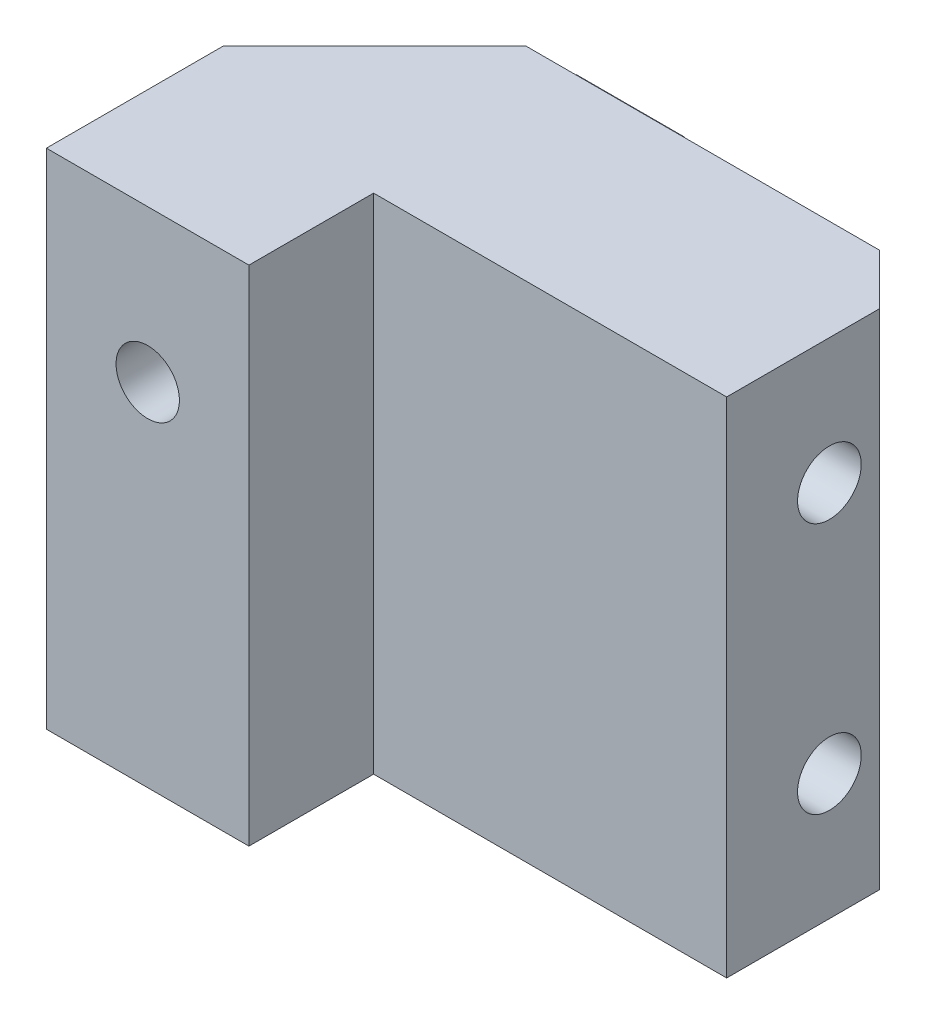
ISO-10303-21;
HEADER;
FILE_DESCRIPTION(('STEP AP214'),'2;1');
FILE_NAME('part.step','',(''),(''),'','','');
FILE_SCHEMA(('AUTOMOTIVE_DESIGN { 1 0 10303 214 1 1 1 1 }'));
ENDSEC;
DATA;
#1=APPLICATION_CONTEXT('core data for automotive mechanical design processes');
#2=APPLICATION_PROTOCOL_DEFINITION('international standard','automotive_design',2000,#1);
#3=PRODUCT_CONTEXT('',#1,'mechanical');
#4=PRODUCT('Part','Part','',(#3));
#5=PRODUCT_RELATED_PRODUCT_CATEGORY('part','',(#4));
#6=PRODUCT_DEFINITION_FORMATION('','',#4);
#7=PRODUCT_DEFINITION_CONTEXT('part definition',#1,'design');
#8=PRODUCT_DEFINITION('design','',#6,#7);
#9=PRODUCT_DEFINITION_SHAPE('','',#8);
#10=(LENGTH_UNIT() NAMED_UNIT(*) SI_UNIT(.MILLI.,.METRE.));
#11=(NAMED_UNIT(*) PLANE_ANGLE_UNIT() SI_UNIT($,.RADIAN.));
#12=(NAMED_UNIT(*) SI_UNIT($,.STERADIAN.) SOLID_ANGLE_UNIT());
#13=UNCERTAINTY_MEASURE_WITH_UNIT(LENGTH_MEASURE(1.E-05),#10,'distance_accuracy_value','');
#14=(GEOMETRIC_REPRESENTATION_CONTEXT(3) GLOBAL_UNCERTAINTY_ASSIGNED_CONTEXT((#13)) GLOBAL_UNIT_ASSIGNED_CONTEXT((#10,
#11,#12)) REPRESENTATION_CONTEXT('',''));
#15=CARTESIAN_POINT('',(0.,0.,0.));
#16=DIRECTION('',(0.,0.,1.));
#17=DIRECTION('',(1.,0.,0.));
#18=AXIS2_PLACEMENT_3D('',#15,#16,#17);
#19=CARTESIAN_POINT('',(12.25,-15.5,-21.47));
#20=DIRECTION('',(-1.,0.,0.));
#21=DIRECTION('',(0.,0.,1.));
#22=AXIS2_PLACEMENT_3D('',#19,#20,#21);
#23=PLANE('',#22);
#24=DIRECTION('',(0.,-1.,0.));
#25=VECTOR('',#24,1.);
#26=CARTESIAN_POINT('',(12.25,-15.5,-20.61));
#27=LINE('',#26,#25);
#28=CARTESIAN_POINT('',(12.25,14.97,-20.61));
#29=VERTEX_POINT('',#28);
#30=CARTESIAN_POINT('',(12.25,-15.5,-20.61));
#31=VERTEX_POINT('',#30);
#32=EDGE_CURVE('E106',#29,#31,#27,.T.);
#33=ORIENTED_EDGE('',*,*,#32,.T.);
#34=DIRECTION('',(0.,0.,1.));
#35=VECTOR('',#34,1.);
#36=CARTESIAN_POINT('',(12.25,-15.5,-21.47));
#37=LINE('',#36,#35);
#38=CARTESIAN_POINT('',(12.25,-15.5,-21.47));
#39=VERTEX_POINT('',#38);
#40=EDGE_CURVE('E12',#39,#31,#37,.T.);
#41=ORIENTED_EDGE('',*,*,#40,.F.);
#42=DIRECTION('',(0.,-1.,0.));
#43=VECTOR('',#42,1.);
#44=CARTESIAN_POINT('',(12.25,-15.5,-21.47));
#45=LINE('',#44,#43);
#46=CARTESIAN_POINT('',(12.25,14.97,-21.47));
#47=VERTEX_POINT('',#46);
#48=EDGE_CURVE('E94',#47,#39,#45,.T.);
#49=ORIENTED_EDGE('',*,*,#48,.F.);
#50=DIRECTION('',(0.,0.,1.));
#51=VECTOR('',#50,1.);
#52=CARTESIAN_POINT('',(12.25,14.97,-21.47));
#53=LINE('',#52,#51);
#54=EDGE_CURVE('E102',#47,#29,#53,.T.);
#55=ORIENTED_EDGE('',*,*,#54,.T.);
#56=EDGE_LOOP('',(#33,#41,#49,#55));
#57=FACE_BOUND('',#56,.T.);
#58=ADVANCED_FACE('F43',(#57),#23,.F.);
#59=CARTESIAN_POINT('',(12.25,-15.5,-21.47));
#60=DIRECTION('',(0.,1.,0.));
#61=DIRECTION('',(0.,0.,1.));
#62=AXIS2_PLACEMENT_3D('',#59,#60,#61);
#63=PLANE('',#62);
#64=DIRECTION('',(-1.,0.,0.));
#65=VECTOR('',#64,1.);
#66=CARTESIAN_POINT('',(12.25,-15.5,-20.61));
#67=LINE('',#66,#65);
#68=CARTESIAN_POINT('',(5.43500000000002,-15.5,-20.61));
#69=VERTEX_POINT('',#68);
#70=EDGE_CURVE('E98',#31,#69,#67,.T.);
#71=ORIENTED_EDGE('',*,*,#70,.T.);
#72=DIRECTION('',(0.,0.,1.));
#73=VECTOR('',#72,1.);
#74=CARTESIAN_POINT('',(5.43500000000002,-15.5,-21.47));
#75=LINE('',#74,#73);
#76=CARTESIAN_POINT('',(5.43500000000002,-15.5,-21.47));
#77=VERTEX_POINT('',#76);
#78=EDGE_CURVE('E51',#77,#69,#75,.T.);
#79=ORIENTED_EDGE('',*,*,#78,.F.);
#80=DIRECTION('',(-1.,0.,0.));
#81=VECTOR('',#80,1.);
#82=CARTESIAN_POINT('',(12.25,-15.5,-21.47));
#83=LINE('',#82,#81);
#84=EDGE_CURVE('E89',#39,#77,#83,.T.);
#85=ORIENTED_EDGE('',*,*,#84,.F.);
#86=ORIENTED_EDGE('',*,*,#40,.T.);
#87=EDGE_LOOP('',(#71,#79,#85,#86));
#88=FACE_BOUND('',#87,.T.);
#89=ADVANCED_FACE('F97',(#88),#63,.F.);
#90=CARTESIAN_POINT('',(5.43500000000002,-15.5,-21.47));
#91=DIRECTION('',(1.,0.,0.));
#92=DIRECTION('',(0.,0.,-1.));
#93=AXIS2_PLACEMENT_3D('',#90,#91,#92);
#94=PLANE('',#93);
#95=DIRECTION('',(0.,1.,0.));
#96=VECTOR('',#95,1.);
#97=CARTESIAN_POINT('',(5.43500000000002,-15.5,-20.61));
#98=LINE('',#97,#96);
#99=CARTESIAN_POINT('',(5.43500000000002,14.97,-20.61));
#100=VERTEX_POINT('',#99);
#101=EDGE_CURVE('E76',#69,#100,#98,.T.);
#102=ORIENTED_EDGE('',*,*,#101,.T.);
#103=DIRECTION('',(0.,0.,1.));
#104=VECTOR('',#103,1.);
#105=CARTESIAN_POINT('',(5.43500000000002,14.97,-21.47));
#106=LINE('',#105,#104);
#107=CARTESIAN_POINT('',(5.43500000000002,14.97,-21.47));
#108=VERTEX_POINT('',#107);
#109=EDGE_CURVE('E99',#108,#100,#106,.T.);
#110=ORIENTED_EDGE('',*,*,#109,.F.);
#111=DIRECTION('',(0.,1.,0.));
#112=VECTOR('',#111,1.);
#113=CARTESIAN_POINT('',(5.43500000000002,-15.5,-21.47));
#114=LINE('',#113,#112);
#115=EDGE_CURVE('E92',#77,#108,#114,.T.);
#116=ORIENTED_EDGE('',*,*,#115,.F.);
#117=ORIENTED_EDGE('',*,*,#78,.T.);
#118=EDGE_LOOP('',(#102,#110,#116,#117));
#119=FACE_BOUND('',#118,.T.);
#120=ADVANCED_FACE('F100',(#119),#94,.F.);
#121=CARTESIAN_POINT('',(12.25,14.97,-21.47));
#122=DIRECTION('',(0.,-1.,0.));
#123=DIRECTION('',(0.,0.,-1.));
#124=AXIS2_PLACEMENT_3D('',#121,#122,#123);
#125=PLANE('',#124);
#126=DIRECTION('',(1.,0.,0.));
#127=VECTOR('',#126,1.);
#128=CARTESIAN_POINT('',(12.25,14.97,-20.61));
#129=LINE('',#128,#127);
#130=EDGE_CURVE('E82',#100,#29,#129,.T.);
#131=ORIENTED_EDGE('',*,*,#130,.T.);
#132=ORIENTED_EDGE('',*,*,#54,.F.);
#133=DIRECTION('',(1.,0.,0.));
#134=VECTOR('',#133,1.);
#135=CARTESIAN_POINT('',(12.25,14.97,-21.47));
#136=LINE('',#135,#134);
#137=EDGE_CURVE('E59',#108,#47,#136,.T.);
#138=ORIENTED_EDGE('',*,*,#137,.F.);
#139=ORIENTED_EDGE('',*,*,#109,.T.);
#140=EDGE_LOOP('',(#131,#132,#138,#139));
#141=FACE_BOUND('',#140,.T.);
#142=ADVANCED_FACE('F113',(#141),#125,.F.);
#143=CARTESIAN_POINT('',(12.25,14.97,-21.47));
#144=DIRECTION('',(0.,0.,1.));
#145=DIRECTION('',(1.,0.,0.));
#146=AXIS2_PLACEMENT_3D('',#143,#144,#145);
#147=PLANE('',#146);
#148=ORIENTED_EDGE('',*,*,#48,.T.);
#149=ORIENTED_EDGE('',*,*,#84,.T.);
#150=ORIENTED_EDGE('',*,*,#115,.T.);
#151=ORIENTED_EDGE('',*,*,#137,.T.);
#152=EDGE_LOOP('',(#148,#149,#150,#151));
#153=FACE_BOUND('',#152,.T.);
#154=ADVANCED_FACE('F90',(#153),#147,.F.);
#155=CARTESIAN_POINT('',(12.25,14.97,-20.61));
#156=DIRECTION('',(0.,0.,1.));
#157=DIRECTION('',(1.,0.,0.));
#158=AXIS2_PLACEMENT_3D('',#155,#156,#157);
#159=PLANE('',#158);
#160=ORIENTED_EDGE('',*,*,#32,.F.);
#161=ORIENTED_EDGE('',*,*,#130,.F.);
#162=ORIENTED_EDGE('',*,*,#101,.F.);
#163=ORIENTED_EDGE('',*,*,#70,.F.);
#164=EDGE_LOOP('',(#160,#161,#162,#163));
#165=FACE_BOUND('',#164,.T.);
#166=ADVANCED_FACE('F116',(#165),#159,.T.);
#167=CLOSED_SHELL('',(#58,#89,#120,#142,#154,#166));
#168=MANIFOLD_SOLID_BREP('B2',#167);
#169=CARTESIAN_POINT('',(-6.365,-15.8,-11.11));
#170=DIRECTION('',(-1.,0.,0.));
#171=DIRECTION('',(0.,0.,1.));
#172=AXIS2_PLACEMENT_3D('',#169,#170,#171);
#173=PLANE('',#172);
#174=DIRECTION('',(0.,1.,0.));
#175=VECTOR('',#174,1.);
#176=CARTESIAN_POINT('',(-6.365,-15.8,0.));
#177=LINE('',#176,#175);
#178=CARTESIAN_POINT('',(-6.365,-15.8,0.));
#179=VERTEX_POINT('',#178);
#180=CARTESIAN_POINT('',(-6.365,15.8,0.));
#181=VERTEX_POINT('',#180);
#182=EDGE_CURVE('E170',#179,#181,#177,.T.);
#183=ORIENTED_EDGE('',*,*,#182,.T.);
#184=DIRECTION('',(0.,0.,1.));
#185=VECTOR('',#184,1.);
#186=CARTESIAN_POINT('',(-6.365,15.8,-11.11));
#187=LINE('',#186,#185);
#188=CARTESIAN_POINT('',(-6.365,15.8,-11.11));
#189=VERTEX_POINT('',#188);
#190=EDGE_CURVE('E231',#189,#181,#187,.T.);
#191=ORIENTED_EDGE('',*,*,#190,.F.);
#192=DIRECTION('',(0.,1.,0.));
#193=VECTOR('',#192,1.);
#194=CARTESIAN_POINT('',(-6.365,-15.8,-11.11));
#195=LINE('',#194,#193);
#196=CARTESIAN_POINT('',(-6.365,-15.8,-11.11));
#197=VERTEX_POINT('',#196);
#198=EDGE_CURVE('E41',#197,#189,#195,.T.);
#199=ORIENTED_EDGE('',*,*,#198,.F.);
#200=DIRECTION('',(0.,0.,1.));
#201=VECTOR('',#200,1.);
#202=CARTESIAN_POINT('',(-6.365,-15.8,-11.11));
#203=LINE('',#202,#201);
#204=EDGE_CURVE('E232',#197,#179,#203,.T.);
#205=ORIENTED_EDGE('',*,*,#204,.T.);
#206=EDGE_LOOP('',(#183,#191,#199,#205));
#207=FACE_BOUND('',#206,.T.);
#208=ADVANCED_FACE('F167',(#207),#173,.T.);
#209=CARTESIAN_POINT('',(3.13500000000002,-15.8,-20.61));
#210=DIRECTION('',(-0.707106781186547,0.,-0.707106781186548));
#211=DIRECTION('',(-0.707106781186548,0.,0.707106781186547));
#212=AXIS2_PLACEMENT_3D('',#209,#210,#211);
#213=PLANE('',#212);
#214=ORIENTED_EDGE('',*,*,#198,.T.);
#215=DIRECTION('',(-0.707106781186548,0.,0.707106781186547));
#216=VECTOR('',#215,1.);
#217=CARTESIAN_POINT('',(3.13500000000002,15.8,-20.61));
#218=LINE('',#217,#216);
#219=CARTESIAN_POINT('',(3.13500000000002,15.8,-20.61));
#220=VERTEX_POINT('',#219);
#221=EDGE_CURVE('E249',#220,#189,#218,.T.);
#222=ORIENTED_EDGE('',*,*,#221,.F.);
#223=DIRECTION('',(0.,1.,0.));
#224=VECTOR('',#223,1.);
#225=CARTESIAN_POINT('',(3.13500000000002,-15.8,-20.61));
#226=LINE('',#225,#224);
#227=CARTESIAN_POINT('',(3.13500000000002,-15.8,-20.61));
#228=VERTEX_POINT('',#227);
#229=EDGE_CURVE('E175',#228,#220,#226,.T.);
#230=ORIENTED_EDGE('',*,*,#229,.F.);
#231=DIRECTION('',(-0.707106781186548,0.,0.707106781186547));
#232=VECTOR('',#231,1.);
#233=CARTESIAN_POINT('',(3.13500000000002,-15.8,-20.61));
#234=LINE('',#233,#232);
#235=EDGE_CURVE('E237',#228,#197,#234,.T.);
#236=ORIENTED_EDGE('',*,*,#235,.T.);
#237=EDGE_LOOP('',(#214,#222,#230,#236));
#238=FACE_BOUND('',#237,.T.);
#239=ADVANCED_FACE('F318',(#238),#213,.T.);
#240=CARTESIAN_POINT('',(25.35,-15.8,-20.61));
#241=DIRECTION('',(0.,0.,-1.));
#242=DIRECTION('',(-1.,0.,0.));
#243=AXIS2_PLACEMENT_3D('',#240,#241,#242);
#244=PLANE('',#243);
#245=ORIENTED_EDGE('',*,*,#229,.T.);
#246=DIRECTION('',(-1.,0.,0.));
#247=VECTOR('',#246,1.);
#248=CARTESIAN_POINT('',(25.35,15.8,-20.61));
#249=LINE('',#248,#247);
#250=CARTESIAN_POINT('',(25.35,15.8,-20.61));
#251=VERTEX_POINT('',#250);
#252=EDGE_CURVE('E267',#251,#220,#249,.T.);
#253=ORIENTED_EDGE('',*,*,#252,.F.);
#254=DIRECTION('',(0.,1.,0.));
#255=VECTOR('',#254,1.);
#256=CARTESIAN_POINT('',(25.35,-15.8,-20.61));
#257=LINE('',#256,#255);
#258=CARTESIAN_POINT('',(25.35,-15.8,-20.61));
#259=VERTEX_POINT('',#258);
#260=EDGE_CURVE('E289',#259,#251,#257,.T.);
#261=ORIENTED_EDGE('',*,*,#260,.F.);
#262=DIRECTION('',(-1.,0.,0.));
#263=VECTOR('',#262,1.);
#264=CARTESIAN_POINT('',(25.35,-15.8,-20.61));
#265=LINE('',#264,#263);
#266=EDGE_CURVE('E285',#259,#228,#265,.T.);
#267=ORIENTED_EDGE('',*,*,#266,.T.);
#268=EDGE_LOOP('',(#245,#253,#261,#267));
#269=FACE_BOUND('',#268,.T.);
#270=ADVANCED_FACE('F317',(#269),#244,.T.);
#271=CARTESIAN_POINT('',(28.525,-15.8,-17.435));
#272=DIRECTION('',(0.707106781186549,0.,-0.707106781186546));
#273=DIRECTION('',(-0.707106781186546,0.,-0.707106781186549));
#274=AXIS2_PLACEMENT_3D('',#271,#272,#273);
#275=PLANE('',#274);
#276=ORIENTED_EDGE('',*,*,#260,.T.);
#277=DIRECTION('',(-0.707106781186546,0.,-0.707106781186549));
#278=VECTOR('',#277,1.);
#279=CARTESIAN_POINT('',(28.525,15.8,-17.435));
#280=LINE('',#279,#278);
#281=CARTESIAN_POINT('',(28.525,15.8,-17.435));
#282=VERTEX_POINT('',#281);
#283=EDGE_CURVE('E264',#282,#251,#280,.T.);
#284=ORIENTED_EDGE('',*,*,#283,.F.);
#285=DIRECTION('',(0.,1.,0.));
#286=VECTOR('',#285,1.);
#287=CARTESIAN_POINT('',(28.525,-15.8,-17.435));
#288=LINE('',#287,#286);
#289=CARTESIAN_POINT('',(28.525,-15.8,-17.435));
#290=VERTEX_POINT('',#289);
#291=EDGE_CURVE('E291',#290,#282,#288,.T.);
#292=ORIENTED_EDGE('',*,*,#291,.F.);
#293=DIRECTION('',(-0.707106781186546,0.,-0.707106781186549));
#294=VECTOR('',#293,1.);
#295=CARTESIAN_POINT('',(28.525,-15.8,-17.435));
#296=LINE('',#295,#294);
#297=EDGE_CURVE('E282',#290,#259,#296,.T.);
#298=ORIENTED_EDGE('',*,*,#297,.T.);
#299=EDGE_LOOP('',(#276,#284,#292,#298));
#300=FACE_BOUND('',#299,.T.);
#301=ADVANCED_FACE('F313',(#300),#275,.T.);
#302=CARTESIAN_POINT('',(28.525,-15.8,-7.83));
#303=DIRECTION('',(1.,0.,0.));
#304=DIRECTION('',(0.,0.,-1.));
#305=AXIS2_PLACEMENT_3D('',#302,#303,#304);
#306=PLANE('',#305);
#307=CARTESIAN_POINT('',(28.525,7.91,-14.28));
#308=DIRECTION('',(1.,0.,0.));
#309=DIRECTION('',(0.,0.,-1.));
#310=AXIS2_PLACEMENT_3D('',#307,#308,#309);
#311=CIRCLE('',#310,2.);
#312=CARTESIAN_POINT('',(28.525,7.91,-16.28));
#313=VERTEX_POINT('',#312);
#314=EDGE_CURVE('E355',#313,#313,#311,.T.);
#315=ORIENTED_EDGE('',*,*,#314,.F.);
#316=EDGE_LOOP('',(#315));
#317=FACE_BOUND('',#316,.T.);
#318=CARTESIAN_POINT('',(28.525,-7.91,-14.28));
#319=DIRECTION('',(1.,0.,0.));
#320=DIRECTION('',(0.,0.,-1.));
#321=AXIS2_PLACEMENT_3D('',#318,#319,#320);
#322=CIRCLE('',#321,2.);
#323=CARTESIAN_POINT('',(28.525,-7.91,-16.28));
#324=VERTEX_POINT('',#323);
#325=EDGE_CURVE('E347',#324,#324,#322,.T.);
#326=ORIENTED_EDGE('',*,*,#325,.F.);
#327=EDGE_LOOP('',(#326));
#328=FACE_BOUND('',#327,.T.);
#329=ORIENTED_EDGE('',*,*,#291,.T.);
#330=DIRECTION('',(0.,0.,-1.));
#331=VECTOR('',#330,1.);
#332=CARTESIAN_POINT('',(28.525,15.8,-7.83));
#333=LINE('',#332,#331);
#334=CARTESIAN_POINT('',(28.525,15.8,-7.83));
#335=VERTEX_POINT('',#334);
#336=EDGE_CURVE('E261',#335,#282,#333,.T.);
#337=ORIENTED_EDGE('',*,*,#336,.F.);
#338=DIRECTION('',(0.,1.,0.));
#339=VECTOR('',#338,1.);
#340=CARTESIAN_POINT('',(28.525,-15.8,-7.83));
#341=LINE('',#340,#339);
#342=CARTESIAN_POINT('',(28.525,-15.8,-7.83));
#343=VERTEX_POINT('',#342);
#344=EDGE_CURVE('E293',#343,#335,#341,.T.);
#345=ORIENTED_EDGE('',*,*,#344,.F.);
#346=DIRECTION('',(0.,0.,-1.));
#347=VECTOR('',#346,1.);
#348=CARTESIAN_POINT('',(28.525,-15.8,-7.83));
#349=LINE('',#348,#347);
#350=EDGE_CURVE('E279',#343,#290,#349,.T.);
#351=ORIENTED_EDGE('',*,*,#350,.T.);
#352=EDGE_LOOP('',(#329,#337,#345,#351));
#353=FACE_BOUND('',#352,.T.);
#354=ADVANCED_FACE('F306',(#317,#328,#353),#306,.T.);
#355=CARTESIAN_POINT('',(6.355,-15.8,-7.83));
#356=DIRECTION('',(0.,0.,1.));
#357=DIRECTION('',(1.,0.,0.));
#358=AXIS2_PLACEMENT_3D('',#355,#356,#357);
#359=PLANE('',#358);
#360=ORIENTED_EDGE('',*,*,#344,.T.);
#361=DIRECTION('',(1.,0.,0.));
#362=VECTOR('',#361,1.);
#363=CARTESIAN_POINT('',(6.355,15.8,-7.83));
#364=LINE('',#363,#362);
#365=CARTESIAN_POINT('',(6.355,15.8,-7.83));
#366=VERTEX_POINT('',#365);
#367=EDGE_CURVE('E258',#366,#335,#364,.T.);
#368=ORIENTED_EDGE('',*,*,#367,.F.);
#369=DIRECTION('',(0.,1.,0.));
#370=VECTOR('',#369,1.);
#371=CARTESIAN_POINT('',(6.355,-15.8,-7.83));
#372=LINE('',#371,#370);
#373=CARTESIAN_POINT('',(6.355,-15.8,-7.83));
#374=VERTEX_POINT('',#373);
#375=EDGE_CURVE('E295',#374,#366,#372,.T.);
#376=ORIENTED_EDGE('',*,*,#375,.F.);
#377=DIRECTION('',(1.,0.,0.));
#378=VECTOR('',#377,1.);
#379=CARTESIAN_POINT('',(6.355,-15.8,-7.83));
#380=LINE('',#379,#378);
#381=EDGE_CURVE('E276',#374,#343,#380,.T.);
#382=ORIENTED_EDGE('',*,*,#381,.T.);
#383=EDGE_LOOP('',(#360,#368,#376,#382));
#384=FACE_BOUND('',#383,.T.);
#385=ADVANCED_FACE('F303',(#384),#359,.T.);
#386=CARTESIAN_POINT('',(6.355,-15.8,0.));
#387=DIRECTION('',(1.,0.,0.));
#388=DIRECTION('',(0.,0.,-1.));
#389=AXIS2_PLACEMENT_3D('',#386,#387,#388);
#390=PLANE('',#389);
#391=ORIENTED_EDGE('',*,*,#375,.T.);
#392=DIRECTION('',(0.,0.,-1.));
#393=VECTOR('',#392,1.);
#394=CARTESIAN_POINT('',(6.355,15.8,0.));
#395=LINE('',#394,#393);
#396=CARTESIAN_POINT('',(6.355,15.8,0.));
#397=VERTEX_POINT('',#396);
#398=EDGE_CURVE('E244',#397,#366,#395,.T.);
#399=ORIENTED_EDGE('',*,*,#398,.F.);
#400=DIRECTION('',(0.,1.,0.));
#401=VECTOR('',#400,1.);
#402=CARTESIAN_POINT('',(6.355,-15.8,0.));
#403=LINE('',#402,#401);
#404=CARTESIAN_POINT('',(6.355,-15.8,0.));
#405=VERTEX_POINT('',#404);
#406=EDGE_CURVE('E236',#405,#397,#403,.T.);
#407=ORIENTED_EDGE('',*,*,#406,.F.);
#408=DIRECTION('',(0.,0.,-1.));
#409=VECTOR('',#408,1.);
#410=CARTESIAN_POINT('',(6.355,-15.8,0.));
#411=LINE('',#410,#409);
#412=EDGE_CURVE('E273',#405,#374,#411,.T.);
#413=ORIENTED_EDGE('',*,*,#412,.T.);
#414=EDGE_LOOP('',(#391,#399,#407,#413));
#415=FACE_BOUND('',#414,.T.);
#416=ADVANCED_FACE('F297',(#415),#390,.T.);
#417=CARTESIAN_POINT('',(-6.365,-15.8,0.));
#418=DIRECTION('',(0.,0.,1.));
#419=DIRECTION('',(1.,0.,0.));
#420=AXIS2_PLACEMENT_3D('',#417,#418,#419);
#421=PLANE('',#420);
#422=CARTESIAN_POINT('',(0.,6.26,0.));
#423=DIRECTION('',(0.,0.,1.));
#424=DIRECTION('',(1.,0.,0.));
#425=AXIS2_PLACEMENT_3D('',#422,#423,#424);
#426=CIRCLE('',#425,1.99);
#427=CARTESIAN_POINT('',(1.99,6.26,0.));
#428=VERTEX_POINT('',#427);
#429=EDGE_CURVE('E253',#428,#428,#426,.T.);
#430=ORIENTED_EDGE('',*,*,#429,.F.);
#431=EDGE_LOOP('',(#430));
#432=FACE_BOUND('',#431,.T.);
#433=ORIENTED_EDGE('',*,*,#406,.T.);
#434=DIRECTION('',(1.,0.,0.));
#435=VECTOR('',#434,1.);
#436=CARTESIAN_POINT('',(-6.365,15.8,0.));
#437=LINE('',#436,#435);
#438=EDGE_CURVE('E239',#181,#397,#437,.T.);
#439=ORIENTED_EDGE('',*,*,#438,.F.);
#440=ORIENTED_EDGE('',*,*,#182,.F.);
#441=DIRECTION('',(1.,0.,0.));
#442=VECTOR('',#441,1.);
#443=CARTESIAN_POINT('',(-6.365,-15.8,0.));
#444=LINE('',#443,#442);
#445=EDGE_CURVE('E271',#179,#405,#444,.T.);
#446=ORIENTED_EDGE('',*,*,#445,.T.);
#447=EDGE_LOOP('',(#433,#439,#440,#446));
#448=FACE_BOUND('',#447,.T.);
#449=ADVANCED_FACE('F240',(#432,#448),#421,.T.);
#450=CARTESIAN_POINT('',(-6.365,-15.8,0.));
#451=DIRECTION('',(0.,1.,0.));
#452=DIRECTION('',(0.,0.,1.));
#453=AXIS2_PLACEMENT_3D('',#450,#451,#452);
#454=PLANE('',#453);
#455=ORIENTED_EDGE('',*,*,#204,.F.);
#456=ORIENTED_EDGE('',*,*,#235,.F.);
#457=ORIENTED_EDGE('',*,*,#266,.F.);
#458=ORIENTED_EDGE('',*,*,#297,.F.);
#459=ORIENTED_EDGE('',*,*,#350,.F.);
#460=ORIENTED_EDGE('',*,*,#381,.F.);
#461=ORIENTED_EDGE('',*,*,#412,.F.);
#462=ORIENTED_EDGE('',*,*,#445,.F.);
#463=EDGE_LOOP('',(#455,#456,#457,#458,#459,#460,#461,#462));
#464=FACE_BOUND('',#463,.T.);
#465=ADVANCED_FACE('F309',(#464),#454,.F.);
#466=CARTESIAN_POINT('',(-6.365,15.8,0.));
#467=DIRECTION('',(0.,1.,0.));
#468=DIRECTION('',(0.,0.,1.));
#469=AXIS2_PLACEMENT_3D('',#466,#467,#468);
#470=PLANE('',#469);
#471=ORIENTED_EDGE('',*,*,#190,.T.);
#472=ORIENTED_EDGE('',*,*,#438,.T.);
#473=ORIENTED_EDGE('',*,*,#398,.T.);
#474=ORIENTED_EDGE('',*,*,#367,.T.);
#475=ORIENTED_EDGE('',*,*,#336,.T.);
#476=ORIENTED_EDGE('',*,*,#283,.T.);
#477=ORIENTED_EDGE('',*,*,#252,.T.);
#478=ORIENTED_EDGE('',*,*,#221,.T.);
#479=EDGE_LOOP('',(#471,#472,#473,#474,#475,#476,#477,#478));
#480=FACE_BOUND('',#479,.T.);
#481=ADVANCED_FACE('F247',(#480),#470,.T.);
#482=CARTESIAN_POINT('',(0.,6.26,-6.15));
#483=DIRECTION('',(0.,0.,1.));
#484=DIRECTION('',(1.,0.,0.));
#485=AXIS2_PLACEMENT_3D('',#482,#483,#484);
#486=CYLINDRICAL_SURFACE('',#485,1.99);
#487=CARTESIAN_POINT('',(0.,6.26,-6.15));
#488=DIRECTION('',(0.,0.,1.));
#489=DIRECTION('',(1.,0.,0.));
#490=AXIS2_PLACEMENT_3D('',#487,#488,#489);
#491=CIRCLE('',#490,1.99);
#492=CARTESIAN_POINT('',(1.99,6.26,-6.15));
#493=VERTEX_POINT('',#492);
#494=EDGE_CURVE('E250',#493,#493,#491,.T.);
#495=ORIENTED_EDGE('',*,*,#494,.F.);
#496=EDGE_LOOP('',(#495));
#497=FACE_BOUND('',#496,.T.);
#498=ORIENTED_EDGE('',*,*,#429,.T.);
#499=EDGE_LOOP('',(#498));
#500=FACE_BOUND('',#499,.T.);
#501=ADVANCED_FACE('F382',(#497,#500),#486,.F.);
#502=CARTESIAN_POINT('',(0.,6.26,-6.15));
#503=DIRECTION('',(0.,0.,1.));
#504=DIRECTION('',(1.,0.,0.));
#505=AXIS2_PLACEMENT_3D('',#502,#503,#504);
#506=PLANE('',#505);
#507=ORIENTED_EDGE('',*,*,#494,.T.);
#508=EDGE_LOOP('',(#507));
#509=FACE_BOUND('',#508,.T.);
#510=ADVANCED_FACE('F374',(#509),#506,.T.);
#511=CARTESIAN_POINT('',(12.325,-7.91,-14.28));
#512=DIRECTION('',(1.,0.,0.));
#513=DIRECTION('',(0.,0.,-1.));
#514=AXIS2_PLACEMENT_3D('',#511,#512,#513);
#515=CYLINDRICAL_SURFACE('',#514,2.);
#516=CARTESIAN_POINT('',(12.325,-7.91,-14.28));
#517=DIRECTION('',(1.,0.,0.));
#518=DIRECTION('',(0.,0.,-1.));
#519=AXIS2_PLACEMENT_3D('',#516,#517,#518);
#520=CIRCLE('',#519,2.);
#521=CARTESIAN_POINT('',(12.325,-7.91,-16.28));
#522=VERTEX_POINT('',#521);
#523=EDGE_CURVE('E345',#522,#522,#520,.T.);
#524=ORIENTED_EDGE('',*,*,#523,.F.);
#525=EDGE_LOOP('',(#524));
#526=FACE_BOUND('',#525,.T.);
#527=ORIENTED_EDGE('',*,*,#325,.T.);
#528=EDGE_LOOP('',(#527));
#529=FACE_BOUND('',#528,.T.);
#530=ADVANCED_FACE('F372',(#526,#529),#515,.F.);
#531=CARTESIAN_POINT('',(12.325,-7.91,-14.28));
#532=DIRECTION('',(1.,0.,0.));
#533=DIRECTION('',(0.,0.,-1.));
#534=AXIS2_PLACEMENT_3D('',#531,#532,#533);
#535=PLANE('',#534);
#536=ORIENTED_EDGE('',*,*,#523,.T.);
#537=EDGE_LOOP('',(#536));
#538=FACE_BOUND('',#537,.T.);
#539=ADVANCED_FACE('F366',(#538),#535,.T.);
#540=CARTESIAN_POINT('',(12.325,7.91,-14.28));
#541=DIRECTION('',(1.,0.,0.));
#542=DIRECTION('',(0.,0.,-1.));
#543=AXIS2_PLACEMENT_3D('',#540,#541,#542);
#544=CYLINDRICAL_SURFACE('',#543,2.);
#545=CARTESIAN_POINT('',(12.325,7.91,-14.28));
#546=DIRECTION('',(1.,0.,0.));
#547=DIRECTION('',(0.,0.,-1.));
#548=AXIS2_PLACEMENT_3D('',#545,#546,#547);
#549=CIRCLE('',#548,2.);
#550=CARTESIAN_POINT('',(12.325,7.91,-16.28));
#551=VERTEX_POINT('',#550);
#552=EDGE_CURVE('E352',#551,#551,#549,.T.);
#553=ORIENTED_EDGE('',*,*,#552,.F.);
#554=EDGE_LOOP('',(#553));
#555=FACE_BOUND('',#554,.T.);
#556=ORIENTED_EDGE('',*,*,#314,.T.);
#557=EDGE_LOOP('',(#556));
#558=FACE_BOUND('',#557,.T.);
#559=ADVANCED_FACE('F363',(#555,#558),#544,.F.);
#560=CARTESIAN_POINT('',(12.325,7.91,-14.28));
#561=DIRECTION('',(1.,0.,0.));
#562=DIRECTION('',(0.,0.,-1.));
#563=AXIS2_PLACEMENT_3D('',#560,#561,#562);
#564=PLANE('',#563);
#565=ORIENTED_EDGE('',*,*,#552,.T.);
#566=EDGE_LOOP('',(#565));
#567=FACE_BOUND('',#566,.T.);
#568=ADVANCED_FACE('F361',(#567),#564,.T.);
#569=CLOSED_SHELL('',(#208,#239,#270,#301,#354,#385,#416,#449,#465,#481,#501,#510,#530,#539,
#559,#568));
#570=MANIFOLD_SOLID_BREP('B6',#569);
#571=ADVANCED_BREP_SHAPE_REPRESENTATION('',(#18,#168,#570),#14);
#572=SHAPE_DEFINITION_REPRESENTATION(#9,#571);
ENDSEC;
END-ISO-10303-21;
